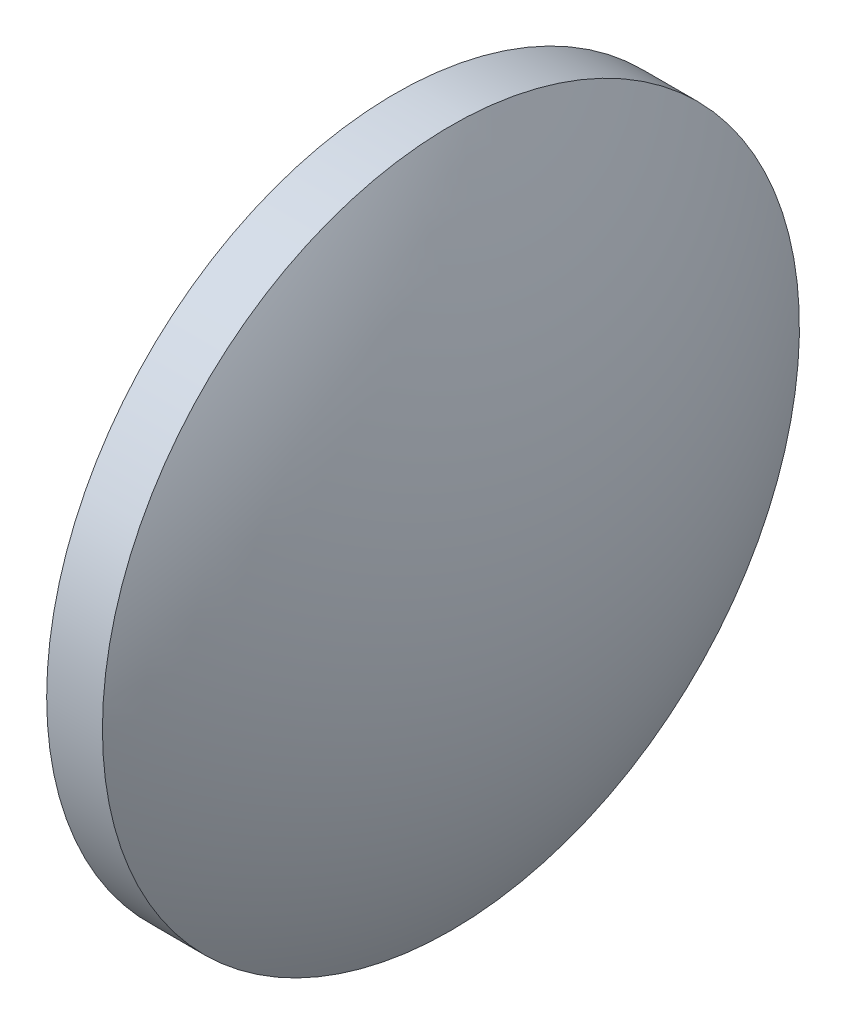
ISO-10303-21;
HEADER;
FILE_DESCRIPTION(('STEP AP214'),'2;1');
FILE_NAME('part.step','',(''),(''),'','','');
FILE_SCHEMA(('AUTOMOTIVE_DESIGN { 1 0 10303 214 1 1 1 1 }'));
ENDSEC;
DATA;
#1=APPLICATION_CONTEXT('core data for automotive mechanical design processes');
#2=APPLICATION_PROTOCOL_DEFINITION('international standard','automotive_design',2000,#1);
#3=PRODUCT_CONTEXT('',#1,'mechanical');
#4=PRODUCT('Part','Part','',(#3));
#5=PRODUCT_RELATED_PRODUCT_CATEGORY('part','',(#4));
#6=PRODUCT_DEFINITION_FORMATION('','',#4);
#7=PRODUCT_DEFINITION_CONTEXT('part definition',#1,'design');
#8=PRODUCT_DEFINITION('design','',#6,#7);
#9=PRODUCT_DEFINITION_SHAPE('','',#8);
#10=(LENGTH_UNIT() NAMED_UNIT(*) SI_UNIT(.MILLI.,.METRE.));
#11=(NAMED_UNIT(*) PLANE_ANGLE_UNIT() SI_UNIT($,.RADIAN.));
#12=(NAMED_UNIT(*) SI_UNIT($,.STERADIAN.) SOLID_ANGLE_UNIT());
#13=UNCERTAINTY_MEASURE_WITH_UNIT(LENGTH_MEASURE(1.E-05),#10,'distance_accuracy_value','');
#14=(GEOMETRIC_REPRESENTATION_CONTEXT(3) GLOBAL_UNCERTAINTY_ASSIGNED_CONTEXT((#13)) GLOBAL_UNIT_ASSIGNED_CONTEXT((#10,
#11,#12)) REPRESENTATION_CONTEXT('',''));
#15=CARTESIAN_POINT('',(0.,0.,0.));
#16=DIRECTION('',(0.,0.,1.));
#17=DIRECTION('',(1.,0.,0.));
#18=AXIS2_PLACEMENT_3D('',#15,#16,#17);
#19=CARTESIAN_POINT('',(453.719632456876,58.1678717271401,0.));
#20=DIRECTION('',(-1.,0.,0.));
#21=DIRECTION('',(0.,-1.,0.));
#22=AXIS2_PLACEMENT_3D('',#19,#20,#21);
#23=SPHERICAL_SURFACE('',#22,15.0625);
#24=CARTESIAN_POINT('',(466.782132456876,58.1678717271401,0.));
#25=DIRECTION('',(-1.,0.,0.));
#26=DIRECTION('',(0.,0.,1.));
#27=AXIS2_PLACEMENT_3D('',#24,#25,#26);
#28=CIRCLE('',#27,7.50000000000001);
#29=CARTESIAN_POINT('',(466.782132456876,58.1678717271401,7.50000000000001));
#30=VERTEX_POINT('',#29);
#31=EDGE_CURVE('E10',#30,#30,#28,.T.);
#32=ORIENTED_EDGE('',*,*,#31,.F.);
#33=EDGE_LOOP('',(#32));
#34=FACE_BOUND('',#33,.T.);
#35=ADVANCED_FACE('F35',(#34),#23,.T.);
#36=CARTESIAN_POINT('',(462.741320326142,58.1678717271401,0.));
#37=DIRECTION('',(-1.,0.,0.));
#38=DIRECTION('',(0.,0.,1.));
#39=AXIS2_PLACEMENT_3D('',#36,#37,#38);
#40=CYLINDRICAL_SURFACE('',#39,7.50000000000001);
#41=CARTESIAN_POINT('',(465.582132456876,58.1678717271401,0.));
#42=DIRECTION('',(-1.,0.,0.));
#43=DIRECTION('',(0.,0.,1.));
#44=AXIS2_PLACEMENT_3D('',#41,#42,#43);
#45=CIRCLE('',#44,7.50000000000001);
#46=CARTESIAN_POINT('',(465.582132456876,58.1678717271401,7.50000000000001));
#47=VERTEX_POINT('',#46);
#48=EDGE_CURVE('E41',#47,#47,#45,.T.);
#49=ORIENTED_EDGE('',*,*,#48,.F.);
#50=EDGE_LOOP('',(#49));
#51=FACE_BOUND('',#50,.T.);
#52=ORIENTED_EDGE('',*,*,#31,.T.);
#53=EDGE_LOOP('',(#52));
#54=FACE_BOUND('',#53,.T.);
#55=ADVANCED_FACE('F49',(#51,#54),#40,.T.);
#56=CARTESIAN_POINT('',(465.582132456876,58.1678717271401,0.));
#57=DIRECTION('',(1.,0.,0.));
#58=DIRECTION('',(0.,0.,-1.));
#59=AXIS2_PLACEMENT_3D('',#56,#57,#58);
#60=PLANE('',#59);
#61=ORIENTED_EDGE('',*,*,#48,.T.);
#62=EDGE_LOOP('',(#61));
#63=FACE_BOUND('',#62,.T.);
#64=ADVANCED_FACE('F47',(#63),#60,.F.);
#65=CLOSED_SHELL('',(#35,#55,#64));
#66=MANIFOLD_SOLID_BREP('B2',#65);
#67=ADVANCED_BREP_SHAPE_REPRESENTATION('',(#18,#66),#14);
#68=SHAPE_DEFINITION_REPRESENTATION(#9,#67);
ENDSEC;
END-ISO-10303-21;
